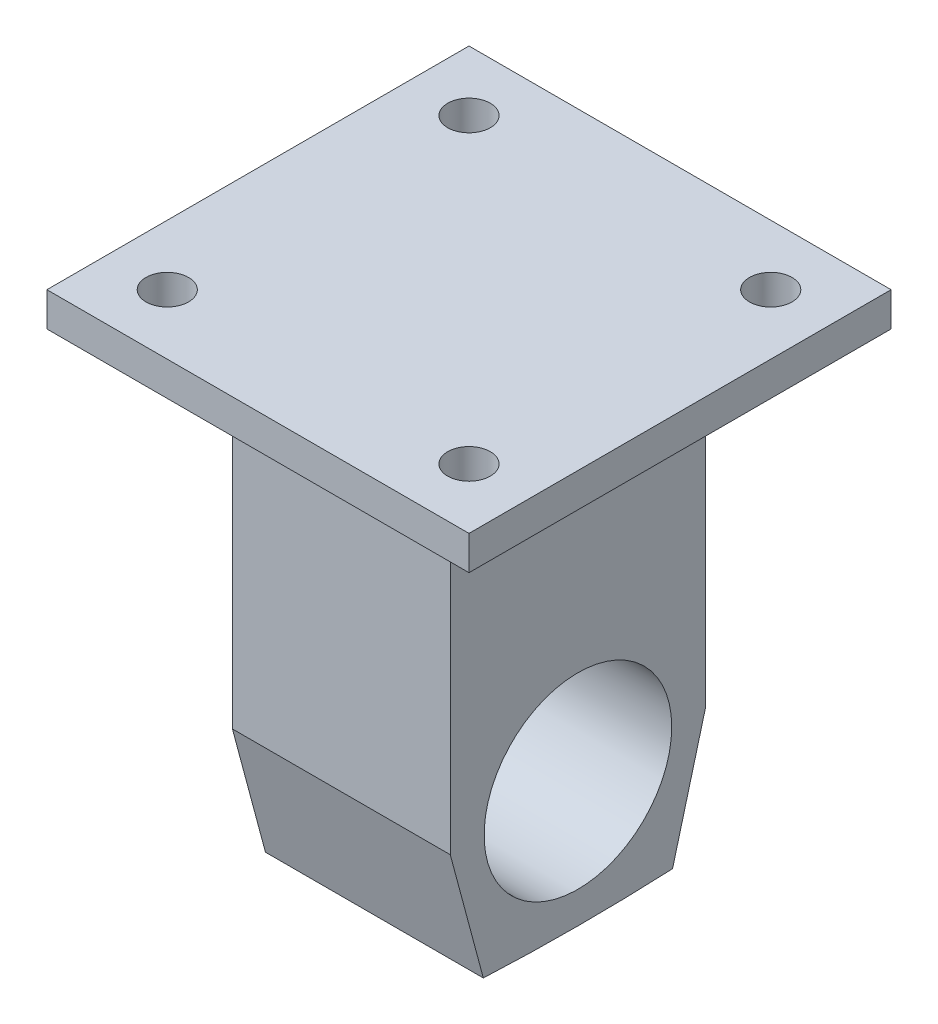
ISO-10303-21;
HEADER;
FILE_DESCRIPTION(('STEP AP214'),'2;1');
FILE_NAME('part.step','',(''),(''),'','','');
FILE_SCHEMA(('AUTOMOTIVE_DESIGN { 1 0 10303 214 1 1 1 1 }'));
ENDSEC;
DATA;
#1=APPLICATION_CONTEXT('core data for automotive mechanical design processes');
#2=APPLICATION_PROTOCOL_DEFINITION('international standard','automotive_design',2000,#1);
#3=PRODUCT_CONTEXT('',#1,'mechanical');
#4=PRODUCT('Part','Part','',(#3));
#5=PRODUCT_RELATED_PRODUCT_CATEGORY('part','',(#4));
#6=PRODUCT_DEFINITION_FORMATION('','',#4);
#7=PRODUCT_DEFINITION_CONTEXT('part definition',#1,'design');
#8=PRODUCT_DEFINITION('design','',#6,#7);
#9=PRODUCT_DEFINITION_SHAPE('','',#8);
#10=(LENGTH_UNIT() NAMED_UNIT(*) SI_UNIT(.MILLI.,.METRE.));
#11=(NAMED_UNIT(*) PLANE_ANGLE_UNIT() SI_UNIT($,.RADIAN.));
#12=(NAMED_UNIT(*) SI_UNIT($,.STERADIAN.) SOLID_ANGLE_UNIT());
#13=UNCERTAINTY_MEASURE_WITH_UNIT(LENGTH_MEASURE(1.E-05),#10,'distance_accuracy_value','');
#14=(GEOMETRIC_REPRESENTATION_CONTEXT(3) GLOBAL_UNCERTAINTY_ASSIGNED_CONTEXT((#13)) GLOBAL_UNIT_ASSIGNED_CONTEXT((#10,
#11,#12)) REPRESENTATION_CONTEXT('',''));
#15=CARTESIAN_POINT('',(0.,0.,0.));
#16=DIRECTION('',(0.,0.,1.));
#17=DIRECTION('',(1.,0.,0.));
#18=AXIS2_PLACEMENT_3D('',#15,#16,#17);
#19=CARTESIAN_POINT('',(16.256,50.292,19.05));
#20=DIRECTION('',(-1.,0.,0.));
#21=DIRECTION('',(0.,0.,1.));
#22=AXIS2_PLACEMENT_3D('',#19,#20,#21);
#23=PLANE('',#22);
#24=CARTESIAN_POINT('',(16.256,0.,0.));
#25=DIRECTION('',(1.,0.,0.));
#26=DIRECTION('',(0.,0.,-1.));
#27=AXIS2_PLACEMENT_3D('',#24,#25,#26);
#28=CIRCLE('',#27,14.);
#29=CARTESIAN_POINT('',(16.256,0.,-14.));
#30=VERTEX_POINT('',#29);
#31=EDGE_CURVE('E135',#30,#30,#28,.T.);
#32=ORIENTED_EDGE('',*,*,#31,.F.);
#33=EDGE_LOOP('',(#32));
#34=FACE_BOUND('',#33,.T.);
#35=DIRECTION('',(0.,-1.,0.));
#36=VECTOR('',#35,1.);
#37=CARTESIAN_POINT('',(16.256,50.292,19.05));
#38=LINE('',#37,#36);
#39=CARTESIAN_POINT('',(16.256,50.292,19.05));
#40=VERTEX_POINT('',#39);
#41=CARTESIAN_POINT('',(16.256,0.,19.05));
#42=VERTEX_POINT('',#41);
#43=EDGE_CURVE('E178',#40,#42,#38,.T.);
#44=ORIENTED_EDGE('',*,*,#43,.T.);
#45=DIRECTION('',(0.,-0.965925826289069,-0.258819045102518));
#46=VECTOR('',#45,1.);
#47=CARTESIAN_POINT('',(16.256,0.,19.05));
#48=LINE('',#47,#46);
#49=CARTESIAN_POINT('',(16.256,-18.4008869908068,14.119497190797));
#50=VERTEX_POINT('',#49);
#51=EDGE_CURVE('E147',#42,#50,#48,.T.);
#52=ORIENTED_EDGE('',*,*,#51,.T.);
#53=CARTESIAN_POINT('',(16.256,281.254621695724,4.34076685363883E-13));
#54=DIRECTION('',(-1.,0.,0.));
#55=DIRECTION('',(0.,0.,1.));
#56=AXIS2_PLACEMENT_3D('',#53,#54,#55);
#57=CIRCLE('',#56,299.987973237435);
#58=CARTESIAN_POINT('',(16.256,-18.4008869908067,-14.119497190797));
#59=VERTEX_POINT('',#58);
#60=EDGE_CURVE('E155',#59,#50,#57,.T.);
#61=ORIENTED_EDGE('',*,*,#60,.F.);
#62=DIRECTION('',(0.,-0.965925826289067,0.258819045102525));
#63=VECTOR('',#62,1.);
#64=CARTESIAN_POINT('',(16.256,0.,-19.05));
#65=LINE('',#64,#63);
#66=CARTESIAN_POINT('',(16.256,0.,-19.05));
#67=VERTEX_POINT('',#66);
#68=EDGE_CURVE('E153',#67,#59,#65,.T.);
#69=ORIENTED_EDGE('',*,*,#68,.F.);
#70=DIRECTION('',(0.,-1.,0.));
#71=VECTOR('',#70,1.);
#72=CARTESIAN_POINT('',(16.256,50.292,-19.05));
#73=LINE('',#72,#71);
#74=CARTESIAN_POINT('',(16.256,50.292,-19.05));
#75=VERTEX_POINT('',#74);
#76=EDGE_CURVE('E11',#75,#67,#73,.T.);
#77=ORIENTED_EDGE('',*,*,#76,.F.);
#78=DIRECTION('',(0.,0.,-1.));
#79=VECTOR('',#78,1.);
#80=CARTESIAN_POINT('',(16.256,50.292,19.05));
#81=LINE('',#80,#79);
#82=EDGE_CURVE('E165',#40,#75,#81,.T.);
#83=ORIENTED_EDGE('',*,*,#82,.F.);
#84=EDGE_LOOP('',(#44,#52,#61,#69,#77,#83));
#85=FACE_BOUND('',#84,.T.);
#86=ADVANCED_FACE('F35',(#34,#85),#23,.F.);
#87=CARTESIAN_POINT('',(-16.256,50.292,-19.05));
#88=DIRECTION('',(0.,0.,1.));
#89=DIRECTION('',(1.,0.,0.));
#90=AXIS2_PLACEMENT_3D('',#87,#88,#89);
#91=PLANE('',#90);
#92=DIRECTION('',(-1.,0.,0.));
#93=VECTOR('',#92,1.);
#94=CARTESIAN_POINT('',(-16.256,0.,-19.05));
#95=LINE('',#94,#93);
#96=CARTESIAN_POINT('',(-16.256,0.,-19.05));
#97=VERTEX_POINT('',#96);
#98=EDGE_CURVE('E164',#67,#97,#95,.T.);
#99=ORIENTED_EDGE('',*,*,#98,.T.);
#100=DIRECTION('',(0.,-1.,0.));
#101=VECTOR('',#100,1.);
#102=CARTESIAN_POINT('',(-16.256,50.292,-19.05));
#103=LINE('',#102,#101);
#104=CARTESIAN_POINT('',(-16.256,50.292,-19.05));
#105=VERTEX_POINT('',#104);
#106=EDGE_CURVE('E44',#105,#97,#103,.T.);
#107=ORIENTED_EDGE('',*,*,#106,.F.);
#108=DIRECTION('',(-1.,0.,0.));
#109=VECTOR('',#108,1.);
#110=CARTESIAN_POINT('',(-16.256,50.292,-19.05));
#111=LINE('',#110,#109);
#112=EDGE_CURVE('E168',#75,#105,#111,.T.);
#113=ORIENTED_EDGE('',*,*,#112,.F.);
#114=ORIENTED_EDGE('',*,*,#76,.T.);
#115=EDGE_LOOP('',(#99,#107,#113,#114));
#116=FACE_BOUND('',#115,.T.);
#117=ADVANCED_FACE('F259',(#116),#91,.F.);
#118=CARTESIAN_POINT('',(-16.256,50.292,19.05));
#119=DIRECTION('',(1.,0.,0.));
#120=DIRECTION('',(0.,0.,-1.));
#121=AXIS2_PLACEMENT_3D('',#118,#119,#120);
#122=PLANE('',#121);
#123=CARTESIAN_POINT('',(-16.256,0.,0.));
#124=DIRECTION('',(1.,0.,0.));
#125=DIRECTION('',(0.,0.,-1.));
#126=AXIS2_PLACEMENT_3D('',#123,#124,#125);
#127=CIRCLE('',#126,14.);
#128=CARTESIAN_POINT('',(-16.256,0.,-14.));
#129=VERTEX_POINT('',#128);
#130=EDGE_CURVE('E138',#129,#129,#127,.T.);
#131=ORIENTED_EDGE('',*,*,#130,.T.);
#132=EDGE_LOOP('',(#131));
#133=FACE_BOUND('',#132,.T.);
#134=ORIENTED_EDGE('',*,*,#106,.T.);
#135=DIRECTION('',(0.,-0.965925826289067,0.258819045102525));
#136=VECTOR('',#135,1.);
#137=CARTESIAN_POINT('',(-16.256,0.,-19.05));
#138=LINE('',#137,#136);
#139=CARTESIAN_POINT('',(-16.256,-18.4008869908067,-14.119497190797));
#140=VERTEX_POINT('',#139);
#141=EDGE_CURVE('E144',#97,#140,#138,.T.);
#142=ORIENTED_EDGE('',*,*,#141,.T.);
#143=CARTESIAN_POINT('',(-16.256,281.254621695724,4.34076685363883E-13));
#144=DIRECTION('',(-1.,0.,0.));
#145=DIRECTION('',(0.,0.,1.));
#146=AXIS2_PLACEMENT_3D('',#143,#144,#145);
#147=CIRCLE('',#146,299.987973237435);
#148=CARTESIAN_POINT('',(-16.256,-18.4008869908068,14.119497190797));
#149=VERTEX_POINT('',#148);
#150=EDGE_CURVE('E146',#140,#149,#147,.T.);
#151=ORIENTED_EDGE('',*,*,#150,.T.);
#152=DIRECTION('',(0.,-0.965925826289069,-0.258819045102518));
#153=VECTOR('',#152,1.);
#154=CARTESIAN_POINT('',(-16.256,0.,19.05));
#155=LINE('',#154,#153);
#156=CARTESIAN_POINT('',(-16.256,0.,19.05));
#157=VERTEX_POINT('',#156);
#158=EDGE_CURVE('E149',#157,#149,#155,.T.);
#159=ORIENTED_EDGE('',*,*,#158,.F.);
#160=DIRECTION('',(0.,-1.,0.));
#161=VECTOR('',#160,1.);
#162=CARTESIAN_POINT('',(-16.256,50.292,19.05));
#163=LINE('',#162,#161);
#164=CARTESIAN_POINT('',(-16.256,50.292,19.05));
#165=VERTEX_POINT('',#164);
#166=EDGE_CURVE('E52',#165,#157,#163,.T.);
#167=ORIENTED_EDGE('',*,*,#166,.F.);
#168=DIRECTION('',(0.,0.,1.));
#169=VECTOR('',#168,1.);
#170=CARTESIAN_POINT('',(-16.256,50.292,19.05));
#171=LINE('',#170,#169);
#172=EDGE_CURVE('E172',#105,#165,#171,.T.);
#173=ORIENTED_EDGE('',*,*,#172,.F.);
#174=EDGE_LOOP('',(#134,#142,#151,#159,#167,#173));
#175=FACE_BOUND('',#174,.T.);
#176=ADVANCED_FACE('F264',(#133,#175),#122,.F.);
#177=CARTESIAN_POINT('',(-16.256,50.292,19.05));
#178=DIRECTION('',(0.,0.,-1.));
#179=DIRECTION('',(-1.,0.,0.));
#180=AXIS2_PLACEMENT_3D('',#177,#178,#179);
#181=PLANE('',#180);
#182=DIRECTION('',(1.,0.,0.));
#183=VECTOR('',#182,1.);
#184=CARTESIAN_POINT('',(-16.256,0.,19.05));
#185=LINE('',#184,#183);
#186=EDGE_CURVE('E169',#157,#42,#185,.T.);
#187=ORIENTED_EDGE('',*,*,#186,.T.);
#188=ORIENTED_EDGE('',*,*,#43,.F.);
#189=DIRECTION('',(1.,0.,0.));
#190=VECTOR('',#189,1.);
#191=CARTESIAN_POINT('',(-16.256,50.292,19.05));
#192=LINE('',#191,#190);
#193=EDGE_CURVE('E175',#165,#40,#192,.T.);
#194=ORIENTED_EDGE('',*,*,#193,.F.);
#195=ORIENTED_EDGE('',*,*,#166,.T.);
#196=EDGE_LOOP('',(#187,#188,#194,#195));
#197=FACE_BOUND('',#196,.T.);
#198=ADVANCED_FACE('F272',(#197),#181,.F.);
#199=CARTESIAN_POINT('',(-16.256,0.,-19.05));
#200=DIRECTION('',(0.,0.258819045102525,0.965925826289067));
#201=DIRECTION('',(0.,-0.965925826289067,0.258819045102525));
#202=AXIS2_PLACEMENT_3D('',#199,#200,#201);
#203=PLANE('',#202);
#204=ORIENTED_EDGE('',*,*,#68,.T.);
#205=DIRECTION('',(1.,0.,0.));
#206=VECTOR('',#205,1.);
#207=CARTESIAN_POINT('',(-16.256,-18.4008869908067,-14.119497190797));
#208=LINE('',#207,#206);
#209=EDGE_CURVE('E161',#140,#59,#208,.T.);
#210=ORIENTED_EDGE('',*,*,#209,.F.);
#211=ORIENTED_EDGE('',*,*,#141,.F.);
#212=ORIENTED_EDGE('',*,*,#98,.F.);
#213=EDGE_LOOP('',(#204,#210,#211,#212));
#214=FACE_BOUND('',#213,.T.);
#215=ADVANCED_FACE('F278',(#214),#203,.F.);
#216=CARTESIAN_POINT('',(-16.256,281.254621695724,4.34076685363883E-13));
#217=DIRECTION('',(1.,0.,0.));
#218=DIRECTION('',(0.,0.,-1.));
#219=AXIS2_PLACEMENT_3D('',#216,#217,#218);
#220=CYLINDRICAL_SURFACE('',#219,299.987973237435);
#221=ORIENTED_EDGE('',*,*,#60,.T.);
#222=DIRECTION('',(1.,0.,0.));
#223=VECTOR('',#222,1.);
#224=CARTESIAN_POINT('',(-16.256,-18.4008869908068,14.119497190797));
#225=LINE('',#224,#223);
#226=EDGE_CURVE('E152',#149,#50,#225,.T.);
#227=ORIENTED_EDGE('',*,*,#226,.F.);
#228=ORIENTED_EDGE('',*,*,#150,.F.);
#229=ORIENTED_EDGE('',*,*,#209,.T.);
#230=EDGE_LOOP('',(#221,#227,#228,#229));
#231=FACE_BOUND('',#230,.T.);
#232=ADVANCED_FACE('F282',(#231),#220,.T.);
#233=CARTESIAN_POINT('',(-16.256,0.,19.05));
#234=DIRECTION('',(0.,-0.258819045102518,0.965925826289069));
#235=DIRECTION('',(0.,-0.965925826289069,-0.258819045102518));
#236=AXIS2_PLACEMENT_3D('',#233,#234,#235);
#237=PLANE('',#236);
#238=ORIENTED_EDGE('',*,*,#51,.F.);
#239=ORIENTED_EDGE('',*,*,#186,.F.);
#240=ORIENTED_EDGE('',*,*,#158,.T.);
#241=ORIENTED_EDGE('',*,*,#226,.T.);
#242=EDGE_LOOP('',(#238,#239,#240,#241));
#243=FACE_BOUND('',#242,.T.);
#244=ADVANCED_FACE('F284',(#243),#237,.T.);
#245=CARTESIAN_POINT('',(-110.744,0.,0.));
#246=DIRECTION('',(1.,0.,0.));
#247=DIRECTION('',(0.,0.,-1.));
#248=AXIS2_PLACEMENT_3D('',#245,#246,#247);
#249=CYLINDRICAL_SURFACE('',#248,14.);
#250=ORIENTED_EDGE('',*,*,#31,.T.);
#251=EDGE_LOOP('',(#250));
#252=FACE_BOUND('',#251,.T.);
#253=ORIENTED_EDGE('',*,*,#130,.F.);
#254=EDGE_LOOP('',(#253));
#255=FACE_BOUND('',#254,.T.);
#256=ADVANCED_FACE('F286',(#252,#255),#249,.F.);
#257=CARTESIAN_POINT('',(-31.4959999999997,55.372,31.4960000000003));
#258=DIRECTION('',(1.,0.,0.));
#259=DIRECTION('',(0.,0.,-1.));
#260=AXIS2_PLACEMENT_3D('',#257,#258,#259);
#261=PLANE('',#260);
#262=DIRECTION('',(0.,0.,1.));
#263=VECTOR('',#262,1.);
#264=CARTESIAN_POINT('',(-31.4959999999997,50.292,31.4960000000003));
#265=LINE('',#264,#263);
#266=CARTESIAN_POINT('',(-31.4960000000003,50.292,-31.4959999999997));
#267=VERTEX_POINT('',#266);
#268=CARTESIAN_POINT('',(-31.4959999999997,50.292,31.4960000000003));
#269=VERTEX_POINT('',#268);
#270=EDGE_CURVE('E134',#267,#269,#265,.T.);
#271=ORIENTED_EDGE('',*,*,#270,.T.);
#272=DIRECTION('',(0.,-1.,0.));
#273=VECTOR('',#272,1.);
#274=CARTESIAN_POINT('',(-31.4959999999997,55.372,31.4960000000003));
#275=LINE('',#274,#273);
#276=CARTESIAN_POINT('',(-31.4959999999997,55.372,31.4960000000003));
#277=VERTEX_POINT('',#276);
#278=EDGE_CURVE('E114',#277,#269,#275,.T.);
#279=ORIENTED_EDGE('',*,*,#278,.F.);
#280=DIRECTION('',(0.,0.,1.));
#281=VECTOR('',#280,1.);
#282=CARTESIAN_POINT('',(-31.4959999999997,55.372,31.4960000000003));
#283=LINE('',#282,#281);
#284=CARTESIAN_POINT('',(-31.4960000000003,55.372,-31.4959999999997));
#285=VERTEX_POINT('',#284);
#286=EDGE_CURVE('E121',#285,#277,#283,.T.);
#287=ORIENTED_EDGE('',*,*,#286,.F.);
#288=DIRECTION('',(0.,-1.,0.));
#289=VECTOR('',#288,1.);
#290=CARTESIAN_POINT('',(-31.4960000000003,55.372,-31.4959999999997));
#291=LINE('',#290,#289);
#292=EDGE_CURVE('E212',#285,#267,#291,.T.);
#293=ORIENTED_EDGE('',*,*,#292,.T.);
#294=EDGE_LOOP('',(#271,#279,#287,#293));
#295=FACE_BOUND('',#294,.T.);
#296=ADVANCED_FACE('F132',(#295),#261,.F.);
#297=CARTESIAN_POINT('',(31.4960000000003,55.372,31.4959999999998));
#298=DIRECTION('',(0.,0.,-1.));
#299=DIRECTION('',(-1.,0.,0.));
#300=AXIS2_PLACEMENT_3D('',#297,#298,#299);
#301=PLANE('',#300);
#302=DIRECTION('',(1.,0.,0.));
#303=VECTOR('',#302,1.);
#304=CARTESIAN_POINT('',(31.4960000000003,50.292,31.4959999999998));
#305=LINE('',#304,#303);
#306=CARTESIAN_POINT('',(31.4960000000003,50.292,31.4959999999998));
#307=VERTEX_POINT('',#306);
#308=EDGE_CURVE('E203',#269,#307,#305,.T.);
#309=ORIENTED_EDGE('',*,*,#308,.T.);
#310=DIRECTION('',(0.,-1.,0.));
#311=VECTOR('',#310,1.);
#312=CARTESIAN_POINT('',(31.4960000000003,55.372,31.4959999999998));
#313=LINE('',#312,#311);
#314=CARTESIAN_POINT('',(31.4960000000003,55.372,31.4959999999998));
#315=VERTEX_POINT('',#314);
#316=EDGE_CURVE('E117',#315,#307,#313,.T.);
#317=ORIENTED_EDGE('',*,*,#316,.F.);
#318=DIRECTION('',(1.,0.,0.));
#319=VECTOR('',#318,1.);
#320=CARTESIAN_POINT('',(31.4960000000003,55.372,31.4959999999998));
#321=LINE('',#320,#319);
#322=EDGE_CURVE('E110',#277,#315,#321,.T.);
#323=ORIENTED_EDGE('',*,*,#322,.F.);
#324=ORIENTED_EDGE('',*,*,#278,.T.);
#325=EDGE_LOOP('',(#309,#317,#323,#324));
#326=FACE_BOUND('',#325,.T.);
#327=ADVANCED_FACE('F112',(#326),#301,.F.);
#328=CARTESIAN_POINT('',(31.4959999999997,55.372,-31.4960000000003));
#329=DIRECTION('',(-1.,0.,0.));
#330=DIRECTION('',(0.,0.,1.));
#331=AXIS2_PLACEMENT_3D('',#328,#329,#330);
#332=PLANE('',#331);
#333=DIRECTION('',(0.,0.,-1.));
#334=VECTOR('',#333,1.);
#335=CARTESIAN_POINT('',(31.4959999999997,50.292,-31.4960000000003));
#336=LINE('',#335,#334);
#337=CARTESIAN_POINT('',(31.4959999999997,50.292,-31.4960000000003));
#338=VERTEX_POINT('',#337);
#339=EDGE_CURVE('E205',#307,#338,#336,.T.);
#340=ORIENTED_EDGE('',*,*,#339,.T.);
#341=DIRECTION('',(0.,-1.,0.));
#342=VECTOR('',#341,1.);
#343=CARTESIAN_POINT('',(31.4959999999997,55.372,-31.4960000000003));
#344=LINE('',#343,#342);
#345=CARTESIAN_POINT('',(31.4959999999997,55.372,-31.4960000000003));
#346=VERTEX_POINT('',#345);
#347=EDGE_CURVE('E140',#346,#338,#344,.T.);
#348=ORIENTED_EDGE('',*,*,#347,.F.);
#349=DIRECTION('',(0.,0.,-1.));
#350=VECTOR('',#349,1.);
#351=CARTESIAN_POINT('',(31.4959999999997,55.372,-31.4960000000003));
#352=LINE('',#351,#350);
#353=EDGE_CURVE('E120',#315,#346,#352,.T.);
#354=ORIENTED_EDGE('',*,*,#353,.F.);
#355=ORIENTED_EDGE('',*,*,#316,.T.);
#356=EDGE_LOOP('',(#340,#348,#354,#355));
#357=FACE_BOUND('',#356,.T.);
#358=ADVANCED_FACE('F222',(#357),#332,.F.);
#359=CARTESIAN_POINT('',(-31.4960000000003,55.372,-31.4959999999997));
#360=DIRECTION('',(0.,0.,1.));
#361=DIRECTION('',(1.,0.,0.));
#362=AXIS2_PLACEMENT_3D('',#359,#360,#361);
#363=PLANE('',#362);
#364=DIRECTION('',(-1.,0.,0.));
#365=VECTOR('',#364,1.);
#366=CARTESIAN_POINT('',(-31.4960000000003,50.292,-31.4959999999997));
#367=LINE('',#366,#365);
#368=EDGE_CURVE('E130',#338,#267,#367,.T.);
#369=ORIENTED_EDGE('',*,*,#368,.T.);
#370=ORIENTED_EDGE('',*,*,#292,.F.);
#371=DIRECTION('',(-1.,0.,0.));
#372=VECTOR('',#371,1.);
#373=CARTESIAN_POINT('',(-31.4960000000003,55.372,-31.4959999999997));
#374=LINE('',#373,#372);
#375=EDGE_CURVE('E126',#346,#285,#374,.T.);
#376=ORIENTED_EDGE('',*,*,#375,.F.);
#377=ORIENTED_EDGE('',*,*,#347,.T.);
#378=EDGE_LOOP('',(#369,#370,#376,#377));
#379=FACE_BOUND('',#378,.T.);
#380=ADVANCED_FACE('F217',(#379),#363,.F.);
#381=CARTESIAN_POINT('',(0.,55.372,0.));
#382=DIRECTION('',(0.,-1.,0.));
#383=DIRECTION('',(0.,0.,-1.));
#384=AXIS2_PLACEMENT_3D('',#381,#382,#383);
#385=PLANE('',#384);
#386=CARTESIAN_POINT('',(22.5157438789306,55.372,-22.5157438789311));
#387=DIRECTION('',(0.,1.,0.));
#388=DIRECTION('',(0.,0.,1.));
#389=AXIS2_PLACEMENT_3D('',#386,#387,#388);
#390=CIRCLE('',#389,3.175);
#391=CARTESIAN_POINT('',(22.5157438789306,55.372,-19.3407438789311));
#392=VERTEX_POINT('',#391);
#393=EDGE_CURVE('E226',#392,#392,#390,.T.);
#394=ORIENTED_EDGE('',*,*,#393,.F.);
#395=EDGE_LOOP('',(#394));
#396=FACE_BOUND('',#395,.T.);
#397=CARTESIAN_POINT('',(-22.5157438789305,55.372,22.5157438789312));
#398=DIRECTION('',(0.,1.,0.));
#399=DIRECTION('',(0.,0.,-1.));
#400=AXIS2_PLACEMENT_3D('',#397,#398,#399);
#401=CIRCLE('',#400,3.175);
#402=CARTESIAN_POINT('',(-22.5157438789305,55.372,19.3407438789312));
#403=VERTEX_POINT('',#402);
#404=EDGE_CURVE('E227',#403,#403,#401,.T.);
#405=ORIENTED_EDGE('',*,*,#404,.F.);
#406=EDGE_LOOP('',(#405));
#407=FACE_BOUND('',#406,.T.);
#408=CARTESIAN_POINT('',(22.5157438789311,55.372,22.5157438789306));
#409=DIRECTION('',(0.,1.,0.));
#410=DIRECTION('',(0.,0.,-1.));
#411=AXIS2_PLACEMENT_3D('',#408,#409,#410);
#412=CIRCLE('',#411,3.175);
#413=CARTESIAN_POINT('',(22.5157438789311,55.372,19.3407438789306));
#414=VERTEX_POINT('',#413);
#415=EDGE_CURVE('E230',#414,#414,#412,.T.);
#416=ORIENTED_EDGE('',*,*,#415,.F.);
#417=EDGE_LOOP('',(#416));
#418=FACE_BOUND('',#417,.T.);
#419=CARTESIAN_POINT('',(-22.5157438789312,55.372,-22.5157438789305));
#420=DIRECTION('',(0.,1.,0.));
#421=DIRECTION('',(0.,0.,1.));
#422=AXIS2_PLACEMENT_3D('',#419,#420,#421);
#423=CIRCLE('',#422,3.17500000000001);
#424=CARTESIAN_POINT('',(-22.5157438789312,55.372,-19.3407438789305));
#425=VERTEX_POINT('',#424);
#426=EDGE_CURVE('E194',#425,#425,#423,.T.);
#427=ORIENTED_EDGE('',*,*,#426,.F.);
#428=EDGE_LOOP('',(#427));
#429=FACE_BOUND('',#428,.T.);
#430=ORIENTED_EDGE('',*,*,#286,.T.);
#431=ORIENTED_EDGE('',*,*,#322,.T.);
#432=ORIENTED_EDGE('',*,*,#353,.T.);
#433=ORIENTED_EDGE('',*,*,#375,.T.);
#434=EDGE_LOOP('',(#430,#431,#432,#433));
#435=FACE_BOUND('',#434,.T.);
#436=ADVANCED_FACE('F124',(#396,#407,#418,#429,#435),#385,.F.);
#437=CARTESIAN_POINT('',(0.,50.292,0.));
#438=DIRECTION('',(0.,-1.,0.));
#439=DIRECTION('',(0.,0.,-1.));
#440=AXIS2_PLACEMENT_3D('',#437,#438,#439);
#441=PLANE('',#440);
#442=CARTESIAN_POINT('',(22.5157438789306,50.292,-22.5157438789311));
#443=DIRECTION('',(0.,-1.,0.));
#444=DIRECTION('',(0.,0.,-1.));
#445=AXIS2_PLACEMENT_3D('',#442,#443,#444);
#446=CIRCLE('',#445,3.175);
#447=CARTESIAN_POINT('',(22.5157438789306,50.292,-25.6907438789311));
#448=VERTEX_POINT('',#447);
#449=EDGE_CURVE('E38',#448,#448,#446,.T.);
#450=ORIENTED_EDGE('',*,*,#449,.F.);
#451=EDGE_LOOP('',(#450));
#452=FACE_BOUND('',#451,.T.);
#453=CARTESIAN_POINT('',(-22.5157438789305,50.292,22.5157438789312));
#454=DIRECTION('',(0.,-1.,0.));
#455=DIRECTION('',(0.,0.,-1.));
#456=AXIS2_PLACEMENT_3D('',#453,#454,#455);
#457=CIRCLE('',#456,3.175);
#458=CARTESIAN_POINT('',(-22.5157438789305,50.292,19.3407438789312));
#459=VERTEX_POINT('',#458);
#460=EDGE_CURVE('E196',#459,#459,#457,.T.);
#461=ORIENTED_EDGE('',*,*,#460,.F.);
#462=EDGE_LOOP('',(#461));
#463=FACE_BOUND('',#462,.T.);
#464=CARTESIAN_POINT('',(22.5157438789311,50.292,22.5157438789306));
#465=DIRECTION('',(0.,-1.,0.));
#466=DIRECTION('',(0.,0.,-1.));
#467=AXIS2_PLACEMENT_3D('',#464,#465,#466);
#468=CIRCLE('',#467,3.175);
#469=CARTESIAN_POINT('',(22.5157438789311,50.292,19.3407438789306));
#470=VERTEX_POINT('',#469);
#471=EDGE_CURVE('E193',#470,#470,#468,.T.);
#472=ORIENTED_EDGE('',*,*,#471,.F.);
#473=EDGE_LOOP('',(#472));
#474=FACE_BOUND('',#473,.T.);
#475=CARTESIAN_POINT('',(-22.5157438789312,50.292,-22.5157438789305));
#476=DIRECTION('',(0.,-1.,0.));
#477=DIRECTION('',(0.,0.,-1.));
#478=AXIS2_PLACEMENT_3D('',#475,#476,#477);
#479=CIRCLE('',#478,3.17500000000001);
#480=CARTESIAN_POINT('',(-22.5157438789312,50.292,-25.6907438789305));
#481=VERTEX_POINT('',#480);
#482=EDGE_CURVE('E190',#481,#481,#479,.T.);
#483=ORIENTED_EDGE('',*,*,#482,.F.);
#484=EDGE_LOOP('',(#483));
#485=FACE_BOUND('',#484,.T.);
#486=ORIENTED_EDGE('',*,*,#193,.T.);
#487=ORIENTED_EDGE('',*,*,#82,.T.);
#488=ORIENTED_EDGE('',*,*,#112,.T.);
#489=ORIENTED_EDGE('',*,*,#172,.T.);
#490=EDGE_LOOP('',(#486,#487,#488,#489));
#491=FACE_BOUND('',#490,.T.);
#492=ORIENTED_EDGE('',*,*,#270,.F.);
#493=ORIENTED_EDGE('',*,*,#368,.F.);
#494=ORIENTED_EDGE('',*,*,#339,.F.);
#495=ORIENTED_EDGE('',*,*,#308,.F.);
#496=EDGE_LOOP('',(#492,#493,#494,#495));
#497=FACE_BOUND('',#496,.T.);
#498=ADVANCED_FACE('F221',(#452,#463,#474,#485,#491,#497),#441,.T.);
#499=CARTESIAN_POINT('',(-22.5157438789312,-18.7333515417117,-22.5157438789305));
#500=DIRECTION('',(0.,1.,0.));
#501=DIRECTION('',(0.,0.,1.));
#502=AXIS2_PLACEMENT_3D('',#499,#500,#501);
#503=CYLINDRICAL_SURFACE('',#502,3.17500000000001);
#504=ORIENTED_EDGE('',*,*,#482,.T.);
#505=EDGE_LOOP('',(#504));
#506=FACE_BOUND('',#505,.T.);
#507=ORIENTED_EDGE('',*,*,#426,.T.);
#508=EDGE_LOOP('',(#507));
#509=FACE_BOUND('',#508,.T.);
#510=ADVANCED_FACE('F244',(#506,#509),#503,.F.);
#511=CARTESIAN_POINT('',(22.5157438789311,-18.7333515417117,22.5157438789306));
#512=DIRECTION('',(0.,1.,0.));
#513=DIRECTION('',(0.,0.,1.));
#514=AXIS2_PLACEMENT_3D('',#511,#512,#513);
#515=CYLINDRICAL_SURFACE('',#514,3.175);
#516=ORIENTED_EDGE('',*,*,#471,.T.);
#517=EDGE_LOOP('',(#516));
#518=FACE_BOUND('',#517,.T.);
#519=ORIENTED_EDGE('',*,*,#415,.T.);
#520=EDGE_LOOP('',(#519));
#521=FACE_BOUND('',#520,.T.);
#522=ADVANCED_FACE('F236',(#518,#521),#515,.F.);
#523=CARTESIAN_POINT('',(-22.5157438789305,-18.7333515417117,22.5157438789312));
#524=DIRECTION('',(0.,1.,0.));
#525=DIRECTION('',(0.,0.,1.));
#526=AXIS2_PLACEMENT_3D('',#523,#524,#525);
#527=CYLINDRICAL_SURFACE('',#526,3.175);
#528=ORIENTED_EDGE('',*,*,#460,.T.);
#529=EDGE_LOOP('',(#528));
#530=FACE_BOUND('',#529,.T.);
#531=ORIENTED_EDGE('',*,*,#404,.T.);
#532=EDGE_LOOP('',(#531));
#533=FACE_BOUND('',#532,.T.);
#534=ADVANCED_FACE('F252',(#530,#533),#527,.F.);
#535=CARTESIAN_POINT('',(22.5157438789306,-18.7333515417117,-22.5157438789311));
#536=DIRECTION('',(0.,1.,0.));
#537=DIRECTION('',(0.,0.,1.));
#538=AXIS2_PLACEMENT_3D('',#535,#536,#537);
#539=CYLINDRICAL_SURFACE('',#538,3.175);
#540=ORIENTED_EDGE('',*,*,#449,.T.);
#541=EDGE_LOOP('',(#540));
#542=FACE_BOUND('',#541,.T.);
#543=ORIENTED_EDGE('',*,*,#393,.T.);
#544=EDGE_LOOP('',(#543));
#545=FACE_BOUND('',#544,.T.);
#546=ADVANCED_FACE('F403',(#542,#545),#539,.F.);
#547=CLOSED_SHELL('',(#86,#117,#176,#198,#215,#232,#244,#256,#296,#327,#358,#380,#436,#498,#510,
#522,#534,#546));
#548=MANIFOLD_SOLID_BREP('B2',#547);
#549=ADVANCED_BREP_SHAPE_REPRESENTATION('',(#18,#548),#14);
#550=SHAPE_DEFINITION_REPRESENTATION(#9,#549);
ENDSEC;
END-ISO-10303-21;
